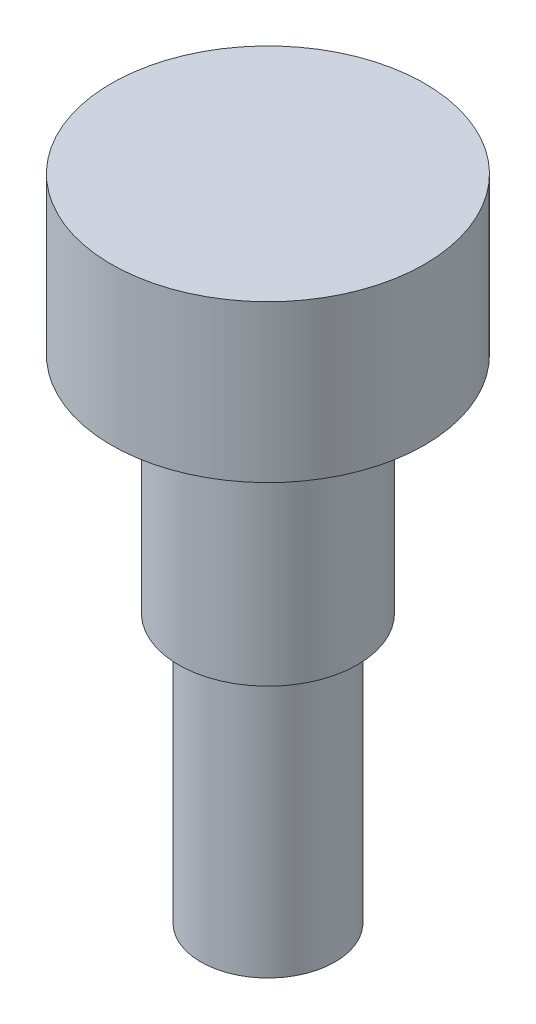
ISO-10303-21;
HEADER;
FILE_DESCRIPTION(('STEP AP214'),'2;1');
FILE_NAME('part.step','',(''),(''),'','','');
FILE_SCHEMA(('AUTOMOTIVE_DESIGN { 1 0 10303 214 1 1 1 1 }'));
ENDSEC;
DATA;
#1=APPLICATION_CONTEXT('core data for automotive mechanical design processes');
#2=APPLICATION_PROTOCOL_DEFINITION('international standard','automotive_design',2000,#1);
#3=PRODUCT_CONTEXT('',#1,'mechanical');
#4=PRODUCT('Part','Part','',(#3));
#5=PRODUCT_RELATED_PRODUCT_CATEGORY('part','',(#4));
#6=PRODUCT_DEFINITION_FORMATION('','',#4);
#7=PRODUCT_DEFINITION_CONTEXT('part definition',#1,'design');
#8=PRODUCT_DEFINITION('design','',#6,#7);
#9=PRODUCT_DEFINITION_SHAPE('','',#8);
#10=(LENGTH_UNIT() NAMED_UNIT(*) SI_UNIT(.MILLI.,.METRE.));
#11=(NAMED_UNIT(*) PLANE_ANGLE_UNIT() SI_UNIT($,.RADIAN.));
#12=(NAMED_UNIT(*) SI_UNIT($,.STERADIAN.) SOLID_ANGLE_UNIT());
#13=UNCERTAINTY_MEASURE_WITH_UNIT(LENGTH_MEASURE(1.E-05),#10,'distance_accuracy_value','');
#14=(GEOMETRIC_REPRESENTATION_CONTEXT(3) GLOBAL_UNCERTAINTY_ASSIGNED_CONTEXT((#13)) GLOBAL_UNIT_ASSIGNED_CONTEXT((#10,
#11,#12)) REPRESENTATION_CONTEXT('',''));
#15=CARTESIAN_POINT('',(0.,0.,0.));
#16=DIRECTION('',(0.,0.,1.));
#17=DIRECTION('',(1.,0.,0.));
#18=AXIS2_PLACEMENT_3D('',#15,#16,#17);
#19=CARTESIAN_POINT('',(0.,0.,0.));
#20=DIRECTION('',(0.,-1.,0.));
#21=DIRECTION('',(1.,0.,0.));
#22=AXIS2_PLACEMENT_3D('',#19,#20,#21);
#23=PLANE('',#22);
#24=CARTESIAN_POINT('',(0.,0.,0.));
#25=DIRECTION('',(0.,-1.,0.));
#26=DIRECTION('',(1.,0.,0.));
#27=AXIS2_PLACEMENT_3D('',#24,#25,#26);
#28=CIRCLE('',#27,3.5);
#29=CARTESIAN_POINT('',(3.5,0.,0.));
#30=VERTEX_POINT('',#29);
#31=EDGE_CURVE('E12',#30,#30,#28,.T.);
#32=ORIENTED_EDGE('',*,*,#31,.F.);
#33=EDGE_LOOP('',(#32));
#34=FACE_BOUND('',#33,.T.);
#35=ADVANCED_FACE('F47',(#34),#23,.F.);
#36=CARTESIAN_POINT('',(0.,-14.5,0.));
#37=DIRECTION('',(0.,-1.,0.));
#38=DIRECTION('',(1.,0.,0.));
#39=AXIS2_PLACEMENT_3D('',#36,#37,#38);
#40=CYLINDRICAL_SURFACE('',#39,3.5);
#41=CARTESIAN_POINT('',(0.,-3.5,0.));
#42=DIRECTION('',(0.,-1.,0.));
#43=DIRECTION('',(1.,0.,0.));
#44=AXIS2_PLACEMENT_3D('',#41,#42,#43);
#45=CIRCLE('',#44,3.5);
#46=CARTESIAN_POINT('',(3.5,-3.5,0.));
#47=VERTEX_POINT('',#46);
#48=EDGE_CURVE('E53',#47,#47,#45,.T.);
#49=ORIENTED_EDGE('',*,*,#48,.F.);
#50=EDGE_LOOP('',(#49));
#51=FACE_BOUND('',#50,.T.);
#52=ORIENTED_EDGE('',*,*,#31,.T.);
#53=EDGE_LOOP('',(#52));
#54=FACE_BOUND('',#53,.T.);
#55=ADVANCED_FACE('F95',(#51,#54),#40,.T.);
#56=CARTESIAN_POINT('',(-3.5,-3.5,0.));
#57=DIRECTION('',(0.,1.,0.));
#58=DIRECTION('',(-1.,0.,0.));
#59=AXIS2_PLACEMENT_3D('',#56,#57,#58);
#60=PLANE('',#59);
#61=CARTESIAN_POINT('',(0.,-3.5,0.));
#62=DIRECTION('',(0.,-1.,0.));
#63=DIRECTION('',(1.,0.,0.));
#64=AXIS2_PLACEMENT_3D('',#61,#62,#63);
#65=CIRCLE('',#64,2.);
#66=CARTESIAN_POINT('',(2.,-3.5,0.));
#67=VERTEX_POINT('',#66);
#68=EDGE_CURVE('E57',#67,#67,#65,.T.);
#69=ORIENTED_EDGE('',*,*,#68,.F.);
#70=EDGE_LOOP('',(#69));
#71=FACE_BOUND('',#70,.T.);
#72=ORIENTED_EDGE('',*,*,#48,.T.);
#73=EDGE_LOOP('',(#72));
#74=FACE_BOUND('',#73,.T.);
#75=ADVANCED_FACE('F90',(#71,#74),#60,.F.);
#76=CARTESIAN_POINT('',(0.,-14.5,0.));
#77=DIRECTION('',(0.,-1.,0.));
#78=DIRECTION('',(1.,0.,0.));
#79=AXIS2_PLACEMENT_3D('',#76,#77,#78);
#80=CYLINDRICAL_SURFACE('',#79,2.);
#81=CARTESIAN_POINT('',(0.,-8.5,0.));
#82=DIRECTION('',(0.,-1.,0.));
#83=DIRECTION('',(1.,0.,0.));
#84=AXIS2_PLACEMENT_3D('',#81,#82,#83);
#85=CIRCLE('',#84,2.);
#86=CARTESIAN_POINT('',(2.,-8.5,0.));
#87=VERTEX_POINT('',#86);
#88=EDGE_CURVE('E61',#87,#87,#85,.T.);
#89=ORIENTED_EDGE('',*,*,#88,.F.);
#90=EDGE_LOOP('',(#89));
#91=FACE_BOUND('',#90,.T.);
#92=ORIENTED_EDGE('',*,*,#68,.T.);
#93=EDGE_LOOP('',(#92));
#94=FACE_BOUND('',#93,.T.);
#95=ADVANCED_FACE('F84',(#91,#94),#80,.T.);
#96=CARTESIAN_POINT('',(-2.,-8.5,0.));
#97=DIRECTION('',(0.,1.,0.));
#98=DIRECTION('',(-1.,0.,0.));
#99=AXIS2_PLACEMENT_3D('',#96,#97,#98);
#100=PLANE('',#99);
#101=CARTESIAN_POINT('',(0.,-8.5,0.));
#102=DIRECTION('',(0.,-1.,0.));
#103=DIRECTION('',(1.,0.,0.));
#104=AXIS2_PLACEMENT_3D('',#101,#102,#103);
#105=CIRCLE('',#104,1.5);
#106=CARTESIAN_POINT('',(1.5,-8.5,0.));
#107=VERTEX_POINT('',#106);
#108=EDGE_CURVE('E66',#107,#107,#105,.T.);
#109=ORIENTED_EDGE('',*,*,#108,.F.);
#110=EDGE_LOOP('',(#109));
#111=FACE_BOUND('',#110,.T.);
#112=ORIENTED_EDGE('',*,*,#88,.T.);
#113=EDGE_LOOP('',(#112));
#114=FACE_BOUND('',#113,.T.);
#115=ADVANCED_FACE('F78',(#111,#114),#100,.F.);
#116=CARTESIAN_POINT('',(0.,-14.5,0.));
#117=DIRECTION('',(0.,-1.,0.));
#118=DIRECTION('',(1.,0.,0.));
#119=AXIS2_PLACEMENT_3D('',#116,#117,#118);
#120=CYLINDRICAL_SURFACE('',#119,1.5);
#121=CARTESIAN_POINT('',(0.,-14.5,0.));
#122=DIRECTION('',(0.,-1.,0.));
#123=DIRECTION('',(1.,0.,0.));
#124=AXIS2_PLACEMENT_3D('',#121,#122,#123);
#125=CIRCLE('',#124,1.5);
#126=CARTESIAN_POINT('',(1.5,-14.5,0.));
#127=VERTEX_POINT('',#126);
#128=EDGE_CURVE('E69',#127,#127,#125,.T.);
#129=ORIENTED_EDGE('',*,*,#128,.F.);
#130=EDGE_LOOP('',(#129));
#131=FACE_BOUND('',#130,.T.);
#132=ORIENTED_EDGE('',*,*,#108,.T.);
#133=EDGE_LOOP('',(#132));
#134=FACE_BOUND('',#133,.T.);
#135=ADVANCED_FACE('F75',(#131,#134),#120,.T.);
#136=CARTESIAN_POINT('',(-1.5,-14.5,0.));
#137=DIRECTION('',(0.,1.,0.));
#138=DIRECTION('',(-1.,0.,0.));
#139=AXIS2_PLACEMENT_3D('',#136,#137,#138);
#140=PLANE('',#139);
#141=ORIENTED_EDGE('',*,*,#128,.T.);
#142=EDGE_LOOP('',(#141));
#143=FACE_BOUND('',#142,.T.);
#144=ADVANCED_FACE('F73',(#143),#140,.F.);
#145=CLOSED_SHELL('',(#35,#55,#75,#95,#115,#135,#144));
#146=MANIFOLD_SOLID_BREP('B2',#145);
#147=ADVANCED_BREP_SHAPE_REPRESENTATION('',(#18,#146),#14);
#148=SHAPE_DEFINITION_REPRESENTATION(#9,#147);
ENDSEC;
END-ISO-10303-21;
